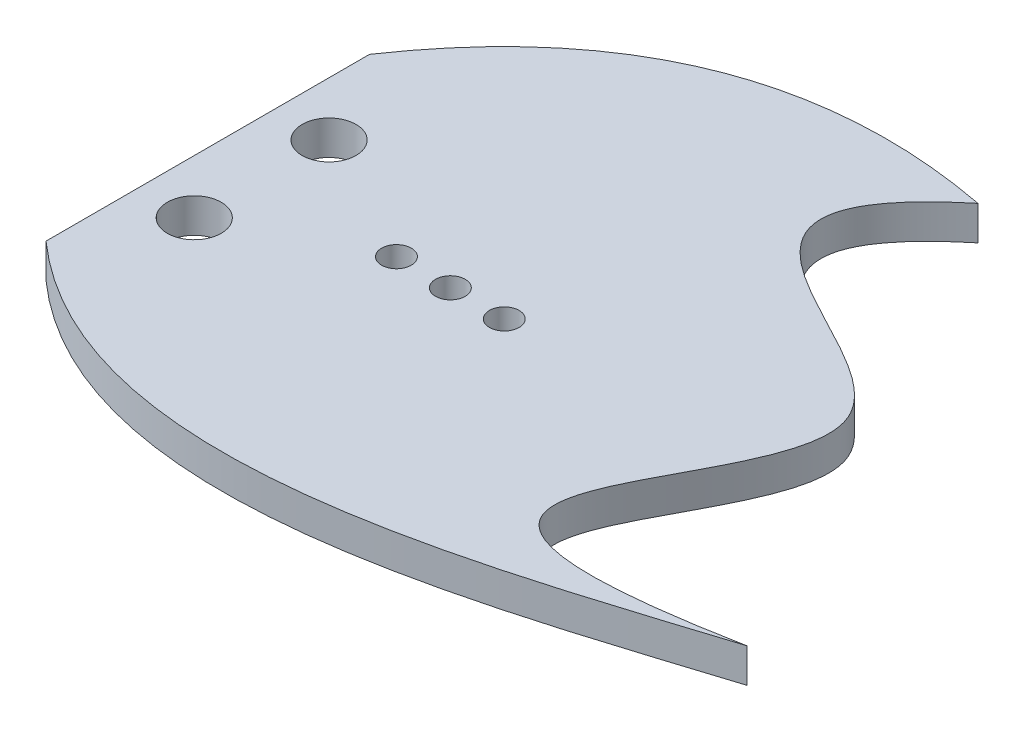
ISO-10303-21;
HEADER;
FILE_DESCRIPTION(('STEP AP214'),'2;1');
FILE_NAME('part.step','',(''),(''),'','','');
FILE_SCHEMA(('AUTOMOTIVE_DESIGN { 1 0 10303 214 1 1 1 1 }'));
ENDSEC;
DATA;
#1=APPLICATION_CONTEXT('core data for automotive mechanical design processes');
#2=APPLICATION_PROTOCOL_DEFINITION('international standard','automotive_design',2000,#1);
#3=PRODUCT_CONTEXT('',#1,'mechanical');
#4=PRODUCT('Part','Part','',(#3));
#5=PRODUCT_RELATED_PRODUCT_CATEGORY('part','',(#4));
#6=PRODUCT_DEFINITION_FORMATION('','',#4);
#7=PRODUCT_DEFINITION_CONTEXT('part definition',#1,'design');
#8=PRODUCT_DEFINITION('design','',#6,#7);
#9=PRODUCT_DEFINITION_SHAPE('','',#8);
#10=(LENGTH_UNIT() NAMED_UNIT(*) SI_UNIT(.MILLI.,.METRE.));
#11=(NAMED_UNIT(*) PLANE_ANGLE_UNIT() SI_UNIT($,.RADIAN.));
#12=(NAMED_UNIT(*) SI_UNIT($,.STERADIAN.) SOLID_ANGLE_UNIT());
#13=UNCERTAINTY_MEASURE_WITH_UNIT(LENGTH_MEASURE(1.E-05),#10,'distance_accuracy_value','');
#14=(GEOMETRIC_REPRESENTATION_CONTEXT(3) GLOBAL_UNCERTAINTY_ASSIGNED_CONTEXT((#13)) GLOBAL_UNIT_ASSIGNED_CONTEXT((#10,
#11,#12)) REPRESENTATION_CONTEXT('',''));
#15=CARTESIAN_POINT('',(0.,0.,0.));
#16=DIRECTION('',(0.,0.,1.));
#17=DIRECTION('',(1.,0.,0.));
#18=AXIS2_PLACEMENT_3D('',#15,#16,#17);
#19=CARTESIAN_POINT('',(90.8163014869139,6.35,-137.475964240362));
#20=DIRECTION('',(0.,1.,0.));
#21=DIRECTION('',(0.,0.,1.));
#22=AXIS2_PLACEMENT_3D('',#19,#20,#21);
#23=PLANE('',#22);
#24=CARTESIAN_POINT('',(111.391825432204,6.35,-78.1513922498747));
#25=DIRECTION('',(0.,1.,0.));
#26=DIRECTION('',(0.,0.,1.));
#27=AXIS2_PLACEMENT_3D('',#24,#25,#26);
#28=CIRCLE('',#27,2.75000000000001);
#29=CARTESIAN_POINT('',(111.391825432204,6.35,-75.4013922498747));
#30=VERTEX_POINT('',#29);
#31=EDGE_CURVE('E163',#30,#30,#28,.T.);
#32=ORIENTED_EDGE('',*,*,#31,.F.);
#33=EDGE_LOOP('',(#32));
#34=FACE_BOUND('',#33,.T.);
#35=CARTESIAN_POINT('',(66.3918254322039,6.35,-90.6513922498747));
#36=DIRECTION('',(0.,1.,0.));
#37=DIRECTION('',(0.,0.,1.));
#38=AXIS2_PLACEMENT_3D('',#35,#36,#37);
#39=CIRCLE('',#38,5.00000000000001);
#40=CARTESIAN_POINT('',(66.3918254322039,6.35,-85.6513922498747));
#41=VERTEX_POINT('',#40);
#42=EDGE_CURVE('E182',#41,#41,#39,.T.);
#43=ORIENTED_EDGE('',*,*,#42,.F.);
#44=EDGE_LOOP('',(#43));
#45=FACE_BOUND('',#44,.T.);
#46=CARTESIAN_POINT('',(66.3918254322039,6.35,-65.6513922498747));
#47=DIRECTION('',(0.,1.,0.));
#48=DIRECTION('',(0.,0.,1.));
#49=AXIS2_PLACEMENT_3D('',#46,#47,#48);
#50=CIRCLE('',#49,5.00000000000001);
#51=CARTESIAN_POINT('',(66.3918254322039,6.35,-60.6513922498747));
#52=VERTEX_POINT('',#51);
#53=EDGE_CURVE('E191',#52,#52,#50,.T.);
#54=ORIENTED_EDGE('',*,*,#53,.F.);
#55=EDGE_LOOP('',(#54));
#56=FACE_BOUND('',#55,.T.);
#57=CARTESIAN_POINT('',(101.391825432204,6.35,-78.1513922498747));
#58=DIRECTION('',(0.,1.,0.));
#59=DIRECTION('',(0.,0.,1.));
#60=AXIS2_PLACEMENT_3D('',#57,#58,#59);
#61=CIRCLE('',#60,2.75000000000001);
#62=CARTESIAN_POINT('',(101.391825432204,6.35,-75.4013922498747));
#63=VERTEX_POINT('',#62);
#64=EDGE_CURVE('E198',#63,#63,#61,.T.);
#65=ORIENTED_EDGE('',*,*,#64,.F.);
#66=EDGE_LOOP('',(#65));
#67=FACE_BOUND('',#66,.T.);
#68=CARTESIAN_POINT('',(136.760588989688,6.35,-140.645969256382));
#69=CARTESIAN_POINT('',(85.056395762882,6.35,-150.553247727596));
#70=CARTESIAN_POINT('',(56.3918254322039,6.35,-108.151392249875));
#71=B_SPLINE_CURVE_WITH_KNOTS('',2,(#68,#69,#70),.UNSPECIFIED.,.F.,.F.,(3,3),(0.,1.),.UNSPECIFIED.);
#72=CARTESIAN_POINT('',(136.760588989688,6.35,-140.645969256382));
#73=VERTEX_POINT('',#72);
#74=CARTESIAN_POINT('',(56.3918254322039,6.35,-108.151392249875));
#75=VERTEX_POINT('',#74);
#76=EDGE_CURVE('E95',#73,#75,#71,.T.);
#77=ORIENTED_EDGE('',*,*,#76,.T.);
#78=DIRECTION('',(0.,0.,1.));
#79=VECTOR('',#78,1.);
#80=CARTESIAN_POINT('',(56.3918254322039,6.35,-108.151392249875));
#81=LINE('',#80,#79);
#82=CARTESIAN_POINT('',(56.3918254322039,6.35,-48.1513922498747));
#83=VERTEX_POINT('',#82);
#84=EDGE_CURVE('E90',#75,#83,#81,.T.);
#85=ORIENTED_EDGE('',*,*,#84,.T.);
#86=CARTESIAN_POINT('',(56.3918254322039,6.35,-48.1513922498747));
#87=CARTESIAN_POINT('',(92.6532218649324,6.35,-15.9656888034696));
#88=CARTESIAN_POINT('',(146.224111166778,6.35,-35.5512807984162));
#89=CARTESIAN_POINT('',(186.391825432204,6.35,-48.1513922498747));
#90=B_SPLINE_CURVE_WITH_KNOTS('',3,(#86,#87,#88,#89),.UNSPECIFIED.,.F.,.F.,(4,4),(0.,1.),.UNSPECIFIED.);
#91=CARTESIAN_POINT('',(186.391825432204,6.35,-48.1513922498747));
#92=VERTEX_POINT('',#91);
#93=EDGE_CURVE('E93',#83,#92,#90,.T.);
#94=ORIENTED_EDGE('',*,*,#93,.T.);
#95=CARTESIAN_POINT('',(186.391825432204,6.35,-48.1513922498747));
#96=CARTESIAN_POINT('',(110.317005066342,6.35,-33.4596870005721));
#97=CARTESIAN_POINT('',(213.908429008098,6.35,-108.517638804358));
#98=CARTESIAN_POINT('',(101.791603924337,6.35,-111.907716317204));
#99=CARTESIAN_POINT('',(136.760588989688,6.35,-140.645969256382));
#100=B_SPLINE_CURVE_WITH_KNOTS('',3,(#95,#96,#97,#98,#99),.UNSPECIFIED.,.F.,.F.,(4,1,4),(0.,
0.539021373963954,1.),.UNSPECIFIED.);
#101=EDGE_CURVE('E60',#92,#73,#100,.T.);
#102=ORIENTED_EDGE('',*,*,#101,.T.);
#103=EDGE_LOOP('',(#77,#85,#94,#102));
#104=FACE_BOUND('',#103,.T.);
#105=CARTESIAN_POINT('',(91.3918254322039,6.35,-78.1513922498747));
#106=DIRECTION('',(0.,1.,0.));
#107=DIRECTION('',(0.,0.,1.));
#108=AXIS2_PLACEMENT_3D('',#105,#106,#107);
#109=CIRCLE('',#108,2.75000000000001);
#110=CARTESIAN_POINT('',(91.3918254322039,6.35,-75.4013922498747));
#111=VERTEX_POINT('',#110);
#112=EDGE_CURVE('E169',#111,#111,#109,.T.);
#113=ORIENTED_EDGE('',*,*,#112,.F.);
#114=EDGE_LOOP('',(#113));
#115=FACE_BOUND('',#114,.T.);
#116=ADVANCED_FACE('F41',(#34,#45,#56,#67,#104,#115),#23,.T.);
#117=CARTESIAN_POINT('',(90.8163014869139,0.,-137.475964240362));
#118=DIRECTION('',(0.,1.,0.));
#119=DIRECTION('',(0.,0.,1.));
#120=AXIS2_PLACEMENT_3D('',#117,#118,#119);
#121=PLANE('',#120);
#122=CARTESIAN_POINT('',(66.3918254322039,0.,-90.6513922498747));
#123=DIRECTION('',(0.,1.,0.));
#124=DIRECTION('',(0.,0.,1.));
#125=AXIS2_PLACEMENT_3D('',#122,#123,#124);
#126=CIRCLE('',#125,5.00000000000001);
#127=CARTESIAN_POINT('',(66.3918254322039,0.,-85.6513922498747));
#128=VERTEX_POINT('',#127);
#129=EDGE_CURVE('E187',#128,#128,#126,.T.);
#130=ORIENTED_EDGE('',*,*,#129,.T.);
#131=EDGE_LOOP('',(#130));
#132=FACE_BOUND('',#131,.T.);
#133=CARTESIAN_POINT('',(66.3918254322039,0.,-65.6513922498747));
#134=DIRECTION('',(0.,1.,0.));
#135=DIRECTION('',(0.,0.,1.));
#136=AXIS2_PLACEMENT_3D('',#133,#134,#135);
#137=CIRCLE('',#136,5.00000000000001);
#138=CARTESIAN_POINT('',(66.3918254322039,0.,-60.6513922498747));
#139=VERTEX_POINT('',#138);
#140=EDGE_CURVE('E173',#139,#139,#137,.T.);
#141=ORIENTED_EDGE('',*,*,#140,.T.);
#142=EDGE_LOOP('',(#141));
#143=FACE_BOUND('',#142,.T.);
#144=CARTESIAN_POINT('',(101.391825432204,0.,-78.1513922498747));
#145=DIRECTION('',(0.,1.,0.));
#146=DIRECTION('',(0.,0.,1.));
#147=AXIS2_PLACEMENT_3D('',#144,#145,#146);
#148=CIRCLE('',#147,2.75000000000001);
#149=CARTESIAN_POINT('',(101.391825432204,0.,-75.4013922498747));
#150=VERTEX_POINT('',#149);
#151=EDGE_CURVE('E186',#150,#150,#148,.T.);
#152=ORIENTED_EDGE('',*,*,#151,.T.);
#153=EDGE_LOOP('',(#152));
#154=FACE_BOUND('',#153,.T.);
#155=CARTESIAN_POINT('',(136.760588989688,0.,-140.645969256382));
#156=CARTESIAN_POINT('',(85.056395762882,0.,-150.553247727596));
#157=CARTESIAN_POINT('',(56.3918254322039,0.,-108.151392249875));
#158=B_SPLINE_CURVE_WITH_KNOTS('',2,(#155,#156,#157),.UNSPECIFIED.,.F.,.F.,(3,3),(0.,1.),.UNSPECIFIED.);
#159=CARTESIAN_POINT('',(136.760588989688,0.,-140.645969256382));
#160=VERTEX_POINT('',#159);
#161=CARTESIAN_POINT('',(56.3918254322039,0.,-108.151392249875));
#162=VERTEX_POINT('',#161);
#163=EDGE_CURVE('E202',#160,#162,#158,.T.);
#164=ORIENTED_EDGE('',*,*,#163,.F.);
#165=CARTESIAN_POINT('',(186.391825432204,0.,-48.1513922498747));
#166=CARTESIAN_POINT('',(110.317005066342,0.,-33.4596870005721));
#167=CARTESIAN_POINT('',(213.908429008098,0.,-108.517638804358));
#168=CARTESIAN_POINT('',(101.791603924337,0.,-111.907716317204));
#169=CARTESIAN_POINT('',(136.760588989688,0.,-140.645969256382));
#170=B_SPLINE_CURVE_WITH_KNOTS('',3,(#165,#166,#167,#168,#169),.UNSPECIFIED.,.F.,.F.,(4,1,4),
(0.,0.539021373963954,1.),.UNSPECIFIED.);
#171=CARTESIAN_POINT('',(186.391825432204,0.,-48.1513922498747));
#172=VERTEX_POINT('',#171);
#173=EDGE_CURVE('E83',#172,#160,#170,.T.);
#174=ORIENTED_EDGE('',*,*,#173,.F.);
#175=CARTESIAN_POINT('',(56.3918254322039,0.,-48.1513922498747));
#176=CARTESIAN_POINT('',(92.6532218649324,0.,-15.9656888034696));
#177=CARTESIAN_POINT('',(146.224111166778,0.,-35.5512807984162));
#178=CARTESIAN_POINT('',(186.391825432204,0.,-48.1513922498747));
#179=B_SPLINE_CURVE_WITH_KNOTS('',3,(#175,#176,#177,#178),.UNSPECIFIED.,.F.,.F.,(4,4),(0.,1.),.UNSPECIFIED.);
#180=CARTESIAN_POINT('',(56.3918254322039,0.,-48.1513922498747));
#181=VERTEX_POINT('',#180);
#182=EDGE_CURVE('E77',#181,#172,#179,.T.);
#183=ORIENTED_EDGE('',*,*,#182,.F.);
#184=DIRECTION('',(0.,0.,1.));
#185=VECTOR('',#184,1.);
#186=CARTESIAN_POINT('',(56.3918254322039,0.,-108.151392249875));
#187=LINE('',#186,#185);
#188=EDGE_CURVE('E100',#162,#181,#187,.T.);
#189=ORIENTED_EDGE('',*,*,#188,.F.);
#190=EDGE_LOOP('',(#164,#174,#183,#189));
#191=FACE_BOUND('',#190,.T.);
#192=CARTESIAN_POINT('',(111.391825432204,0.,-78.1513922498747));
#193=DIRECTION('',(0.,1.,0.));
#194=DIRECTION('',(0.,0.,1.));
#195=AXIS2_PLACEMENT_3D('',#192,#193,#194);
#196=CIRCLE('',#195,2.75000000000001);
#197=CARTESIAN_POINT('',(111.391825432204,0.,-75.4013922498747));
#198=VERTEX_POINT('',#197);
#199=EDGE_CURVE('E166',#198,#198,#196,.T.);
#200=ORIENTED_EDGE('',*,*,#199,.T.);
#201=EDGE_LOOP('',(#200));
#202=FACE_BOUND('',#201,.T.);
#203=CARTESIAN_POINT('',(91.3918254322039,0.,-78.1513922498747));
#204=DIRECTION('',(0.,1.,0.));
#205=DIRECTION('',(0.,0.,1.));
#206=AXIS2_PLACEMENT_3D('',#203,#204,#205);
#207=CIRCLE('',#206,2.75000000000001);
#208=CARTESIAN_POINT('',(91.3918254322039,0.,-75.4013922498747));
#209=VERTEX_POINT('',#208);
#210=EDGE_CURVE('E176',#209,#209,#207,.T.);
#211=ORIENTED_EDGE('',*,*,#210,.T.);
#212=EDGE_LOOP('',(#211));
#213=FACE_BOUND('',#212,.T.);
#214=ADVANCED_FACE('F128',(#132,#143,#154,#191,#202,#213),#121,.F.);
#215=DIRECTION('',(0.,-1.,0.));
#216=VECTOR('',#215,1.);
#217=SURFACE_OF_LINEAR_EXTRUSION('',#71,#216);
#218=ORIENTED_EDGE('',*,*,#163,.T.);
#219=DIRECTION('',(0.,-1.,0.));
#220=VECTOR('',#219,1.);
#221=CARTESIAN_POINT('',(56.3918254322039,6.35,-108.151392249875));
#222=LINE('',#221,#220);
#223=EDGE_CURVE('E11',#75,#162,#222,.T.);
#224=ORIENTED_EDGE('',*,*,#223,.F.);
#225=ORIENTED_EDGE('',*,*,#76,.F.);
#226=DIRECTION('',(0.,-1.,0.));
#227=VECTOR('',#226,1.);
#228=CARTESIAN_POINT('',(136.760588989688,6.35,-140.645969256382));
#229=LINE('',#228,#227);
#230=EDGE_CURVE('E107',#73,#160,#229,.T.);
#231=ORIENTED_EDGE('',*,*,#230,.T.);
#232=EDGE_LOOP('',(#218,#224,#225,#231));
#233=FACE_BOUND('',#232,.T.);
#234=ADVANCED_FACE('F43',(#233),#217,.F.);
#235=CARTESIAN_POINT('',(56.3918254322039,6.35,-108.151392249875));
#236=DIRECTION('',(1.,0.,0.));
#237=DIRECTION('',(0.,0.,-1.));
#238=AXIS2_PLACEMENT_3D('',#235,#236,#237);
#239=PLANE('',#238);
#240=ORIENTED_EDGE('',*,*,#188,.T.);
#241=DIRECTION('',(0.,-1.,0.));
#242=VECTOR('',#241,1.);
#243=CARTESIAN_POINT('',(56.3918254322039,6.35,-48.1513922498747));
#244=LINE('',#243,#242);
#245=EDGE_CURVE('E52',#83,#181,#244,.T.);
#246=ORIENTED_EDGE('',*,*,#245,.F.);
#247=ORIENTED_EDGE('',*,*,#84,.F.);
#248=ORIENTED_EDGE('',*,*,#223,.T.);
#249=EDGE_LOOP('',(#240,#246,#247,#248));
#250=FACE_BOUND('',#249,.T.);
#251=ADVANCED_FACE('F99',(#250),#239,.F.);
#252=DIRECTION('',(0.,-1.,0.));
#253=VECTOR('',#252,1.);
#254=SURFACE_OF_LINEAR_EXTRUSION('',#90,#253);
#255=ORIENTED_EDGE('',*,*,#182,.T.);
#256=DIRECTION('',(0.,-1.,0.));
#257=VECTOR('',#256,1.);
#258=CARTESIAN_POINT('',(186.391825432204,6.35,-48.1513922498747));
#259=LINE('',#258,#257);
#260=EDGE_CURVE('E102',#92,#172,#259,.T.);
#261=ORIENTED_EDGE('',*,*,#260,.F.);
#262=ORIENTED_EDGE('',*,*,#93,.F.);
#263=ORIENTED_EDGE('',*,*,#245,.T.);
#264=EDGE_LOOP('',(#255,#261,#262,#263));
#265=FACE_BOUND('',#264,.T.);
#266=ADVANCED_FACE('F103',(#265),#254,.F.);
#267=DIRECTION('',(0.,-1.,0.));
#268=VECTOR('',#267,1.);
#269=SURFACE_OF_LINEAR_EXTRUSION('',#100,#268);
#270=ORIENTED_EDGE('',*,*,#173,.T.);
#271=ORIENTED_EDGE('',*,*,#230,.F.);
#272=ORIENTED_EDGE('',*,*,#101,.F.);
#273=ORIENTED_EDGE('',*,*,#260,.T.);
#274=EDGE_LOOP('',(#270,#271,#272,#273));
#275=FACE_BOUND('',#274,.T.);
#276=ADVANCED_FACE('F122',(#275),#269,.F.);
#277=CARTESIAN_POINT('',(101.391825432204,6.35,-78.1513922498747));
#278=DIRECTION('',(0.,-1.,0.));
#279=DIRECTION('',(0.,0.,-1.));
#280=AXIS2_PLACEMENT_3D('',#277,#278,#279);
#281=CYLINDRICAL_SURFACE('',#280,2.75000000000001);
#282=ORIENTED_EDGE('',*,*,#64,.T.);
#283=EDGE_LOOP('',(#282));
#284=FACE_BOUND('',#283,.T.);
#285=ORIENTED_EDGE('',*,*,#151,.F.);
#286=EDGE_LOOP('',(#285));
#287=FACE_BOUND('',#286,.T.);
#288=ADVANCED_FACE('F140',(#284,#287),#281,.F.);
#289=CARTESIAN_POINT('',(66.3918254322039,6.35,-65.6513922498747));
#290=DIRECTION('',(0.,-1.,0.));
#291=DIRECTION('',(0.,0.,-1.));
#292=AXIS2_PLACEMENT_3D('',#289,#290,#291);
#293=CYLINDRICAL_SURFACE('',#292,5.00000000000001);
#294=ORIENTED_EDGE('',*,*,#53,.T.);
#295=EDGE_LOOP('',(#294));
#296=FACE_BOUND('',#295,.T.);
#297=ORIENTED_EDGE('',*,*,#140,.F.);
#298=EDGE_LOOP('',(#297));
#299=FACE_BOUND('',#298,.T.);
#300=ADVANCED_FACE('F143',(#296,#299),#293,.F.);
#301=CARTESIAN_POINT('',(66.3918254322039,6.35,-90.6513922498747));
#302=DIRECTION('',(0.,-1.,0.));
#303=DIRECTION('',(0.,0.,-1.));
#304=AXIS2_PLACEMENT_3D('',#301,#302,#303);
#305=CYLINDRICAL_SURFACE('',#304,5.00000000000001);
#306=ORIENTED_EDGE('',*,*,#42,.T.);
#307=EDGE_LOOP('',(#306));
#308=FACE_BOUND('',#307,.T.);
#309=ORIENTED_EDGE('',*,*,#129,.F.);
#310=EDGE_LOOP('',(#309));
#311=FACE_BOUND('',#310,.T.);
#312=ADVANCED_FACE('F147',(#308,#311),#305,.F.);
#313=CARTESIAN_POINT('',(111.391825432204,6.35,-78.1513922498747));
#314=DIRECTION('',(0.,-1.,0.));
#315=DIRECTION('',(0.,0.,-1.));
#316=AXIS2_PLACEMENT_3D('',#313,#314,#315);
#317=CYLINDRICAL_SURFACE('',#316,2.75000000000001);
#318=ORIENTED_EDGE('',*,*,#31,.T.);
#319=EDGE_LOOP('',(#318));
#320=FACE_BOUND('',#319,.T.);
#321=ORIENTED_EDGE('',*,*,#199,.F.);
#322=EDGE_LOOP('',(#321));
#323=FACE_BOUND('',#322,.T.);
#324=ADVANCED_FACE('F151',(#320,#323),#317,.F.);
#325=CARTESIAN_POINT('',(91.3918254322039,6.35,-78.1513922498747));
#326=DIRECTION('',(0.,-1.,0.));
#327=DIRECTION('',(0.,0.,-1.));
#328=AXIS2_PLACEMENT_3D('',#325,#326,#327);
#329=CYLINDRICAL_SURFACE('',#328,2.75000000000001);
#330=ORIENTED_EDGE('',*,*,#112,.T.);
#331=EDGE_LOOP('',(#330));
#332=FACE_BOUND('',#331,.T.);
#333=ORIENTED_EDGE('',*,*,#210,.F.);
#334=EDGE_LOOP('',(#333));
#335=FACE_BOUND('',#334,.T.);
#336=ADVANCED_FACE('F153',(#332,#335),#329,.F.);
#337=CLOSED_SHELL('',(#116,#214,#234,#251,#266,#276,#288,#300,#312,#324,#336));
#338=MANIFOLD_SOLID_BREP('B2',#337);
#339=ADVANCED_BREP_SHAPE_REPRESENTATION('',(#18,#338),#14);
#340=SHAPE_DEFINITION_REPRESENTATION(#9,#339);
ENDSEC;
END-ISO-10303-21;
